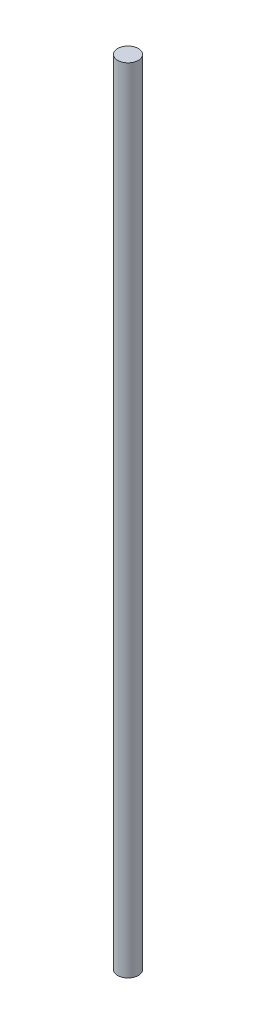
ISO-10303-21;
HEADER;
FILE_DESCRIPTION(('STEP AP214'),'2;1');
FILE_NAME('part.step','',(''),(''),'','','');
FILE_SCHEMA(('AUTOMOTIVE_DESIGN { 1 0 10303 214 1 1 1 1 }'));
ENDSEC;
DATA;
#1=APPLICATION_CONTEXT('core data for automotive mechanical design processes');
#2=APPLICATION_PROTOCOL_DEFINITION('international standard','automotive_design',2000,#1);
#3=PRODUCT_CONTEXT('',#1,'mechanical');
#4=PRODUCT('Part','Part','',(#3));
#5=PRODUCT_RELATED_PRODUCT_CATEGORY('part','',(#4));
#6=PRODUCT_DEFINITION_FORMATION('','',#4);
#7=PRODUCT_DEFINITION_CONTEXT('part definition',#1,'design');
#8=PRODUCT_DEFINITION('design','',#6,#7);
#9=PRODUCT_DEFINITION_SHAPE('','',#8);
#10=(LENGTH_UNIT() NAMED_UNIT(*) SI_UNIT(.MILLI.,.METRE.));
#11=(NAMED_UNIT(*) PLANE_ANGLE_UNIT() SI_UNIT($,.RADIAN.));
#12=(NAMED_UNIT(*) SI_UNIT($,.STERADIAN.) SOLID_ANGLE_UNIT());
#13=UNCERTAINTY_MEASURE_WITH_UNIT(LENGTH_MEASURE(1.E-05),#10,'distance_accuracy_value','');
#14=(GEOMETRIC_REPRESENTATION_CONTEXT(3) GLOBAL_UNCERTAINTY_ASSIGNED_CONTEXT((#13)) GLOBAL_UNIT_ASSIGNED_CONTEXT((#10,
#11,#12)) REPRESENTATION_CONTEXT('',''));
#15=CARTESIAN_POINT('',(0.,0.,0.));
#16=DIRECTION('',(0.,0.,1.));
#17=DIRECTION('',(1.,0.,0.));
#18=AXIS2_PLACEMENT_3D('',#15,#16,#17);
#19=CARTESIAN_POINT('',(0.,304.8,0.));
#20=DIRECTION('',(0.,-1.,0.));
#21=DIRECTION('',(0.,0.,-1.));
#22=AXIS2_PLACEMENT_3D('',#19,#20,#21);
#23=CYLINDRICAL_SURFACE('',#22,3.96875);
#24=CARTESIAN_POINT('',(0.,304.8,0.));
#25=DIRECTION('',(0.,1.,0.));
#26=DIRECTION('',(0.,0.,1.));
#27=AXIS2_PLACEMENT_3D('',#24,#25,#26);
#28=CIRCLE('',#27,3.96875);
#29=CARTESIAN_POINT('',(0.,304.8,3.96875));
#30=VERTEX_POINT('',#29);
#31=EDGE_CURVE('E10',#30,#30,#28,.T.);
#32=ORIENTED_EDGE('',*,*,#31,.F.);
#33=EDGE_LOOP('',(#32));
#34=FACE_BOUND('',#33,.T.);
#35=CARTESIAN_POINT('',(0.,0.,0.));
#36=DIRECTION('',(0.,1.,0.));
#37=DIRECTION('',(0.,0.,1.));
#38=AXIS2_PLACEMENT_3D('',#35,#36,#37);
#39=CIRCLE('',#38,3.96875);
#40=CARTESIAN_POINT('',(0.,0.,3.96875));
#41=VERTEX_POINT('',#40);
#42=EDGE_CURVE('E34',#41,#41,#39,.T.);
#43=ORIENTED_EDGE('',*,*,#42,.T.);
#44=EDGE_LOOP('',(#43));
#45=FACE_BOUND('',#44,.T.);
#46=ADVANCED_FACE('F31',(#34,#45),#23,.T.);
#47=CARTESIAN_POINT('',(0.,304.8,0.));
#48=DIRECTION('',(0.,1.,0.));
#49=DIRECTION('',(0.,0.,1.));
#50=AXIS2_PLACEMENT_3D('',#47,#48,#49);
#51=PLANE('',#50);
#52=ORIENTED_EDGE('',*,*,#31,.T.);
#53=EDGE_LOOP('',(#52));
#54=FACE_BOUND('',#53,.T.);
#55=ADVANCED_FACE('F46',(#54),#51,.T.);
#56=CARTESIAN_POINT('',(0.,0.,0.));
#57=DIRECTION('',(0.,1.,0.));
#58=DIRECTION('',(0.,0.,1.));
#59=AXIS2_PLACEMENT_3D('',#56,#57,#58);
#60=PLANE('',#59);
#61=ORIENTED_EDGE('',*,*,#42,.F.);
#62=EDGE_LOOP('',(#61));
#63=FACE_BOUND('',#62,.T.);
#64=ADVANCED_FACE('F44',(#63),#60,.F.);
#65=CLOSED_SHELL('',(#46,#55,#64));
#66=MANIFOLD_SOLID_BREP('B2',#65);
#67=ADVANCED_BREP_SHAPE_REPRESENTATION('',(#18,#66),#14);
#68=SHAPE_DEFINITION_REPRESENTATION(#9,#67);
ENDSEC;
END-ISO-10303-21;
